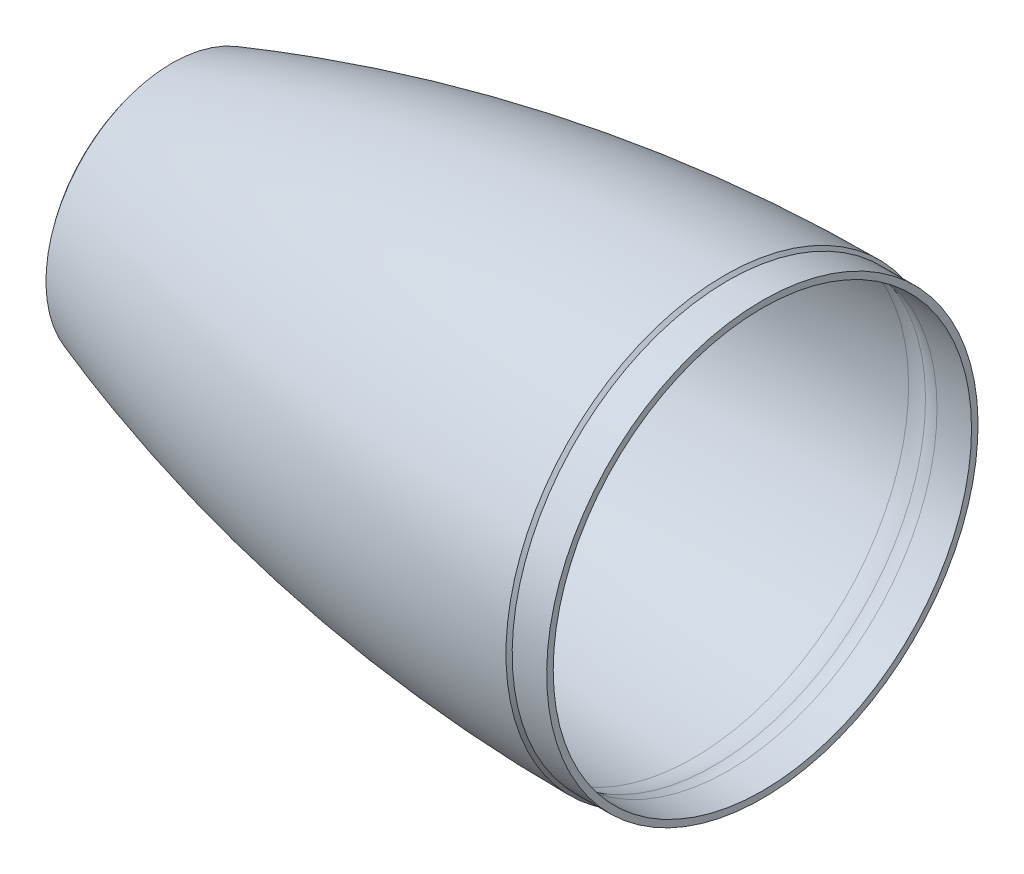
ISO-10303-21;
HEADER;
FILE_DESCRIPTION(('STEP AP214'),'2;1');
FILE_NAME('part.step','',(''),(''),'','','');
FILE_SCHEMA(('AUTOMOTIVE_DESIGN { 1 0 10303 214 1 1 1 1 }'));
ENDSEC;
DATA;
#1=APPLICATION_CONTEXT('core data for automotive mechanical design processes');
#2=APPLICATION_PROTOCOL_DEFINITION('international standard','automotive_design',2000,#1);
#3=PRODUCT_CONTEXT('',#1,'mechanical');
#4=PRODUCT('Part','Part','',(#3));
#5=PRODUCT_RELATED_PRODUCT_CATEGORY('part','',(#4));
#6=PRODUCT_DEFINITION_FORMATION('','',#4);
#7=PRODUCT_DEFINITION_CONTEXT('part definition',#1,'design');
#8=PRODUCT_DEFINITION('design','',#6,#7);
#9=PRODUCT_DEFINITION_SHAPE('','',#8);
#10=(LENGTH_UNIT() NAMED_UNIT(*) SI_UNIT(.MILLI.,.METRE.));
#11=(NAMED_UNIT(*) PLANE_ANGLE_UNIT() SI_UNIT($,.RADIAN.));
#12=(NAMED_UNIT(*) SI_UNIT($,.STERADIAN.) SOLID_ANGLE_UNIT());
#13=UNCERTAINTY_MEASURE_WITH_UNIT(LENGTH_MEASURE(1.E-05),#10,'distance_accuracy_value','');
#14=(GEOMETRIC_REPRESENTATION_CONTEXT(3) GLOBAL_UNCERTAINTY_ASSIGNED_CONTEXT((#13)) GLOBAL_UNIT_ASSIGNED_CONTEXT((#10,
#11,#12)) REPRESENTATION_CONTEXT('',''));
#15=CARTESIAN_POINT('',(0.,0.,0.));
#16=DIRECTION('',(0.,0.,1.));
#17=DIRECTION('',(1.,0.,0.));
#18=AXIS2_PLACEMENT_3D('',#15,#16,#17);
#19=CARTESIAN_POINT('',(-203.454,46.355,0.));
#20=DIRECTION('',(-1.,0.,0.));
#21=DIRECTION('',(0.,-1.,0.));
#22=AXIS2_PLACEMENT_3D('',#19,#20,#21);
#23=PLANE('',#22);
#24=CARTESIAN_POINT('',(-203.454,0.,0.));
#25=DIRECTION('',(1.,0.,0.));
#26=DIRECTION('',(0.,1.,0.));
#27=AXIS2_PLACEMENT_3D('',#24,#25,#26);
#28=CIRCLE('',#27,46.355);
#29=CARTESIAN_POINT('',(-203.454,46.355,0.));
#30=VERTEX_POINT('',#29);
#31=EDGE_CURVE('E55',#30,#30,#28,.T.);
#32=ORIENTED_EDGE('',*,*,#31,.F.);
#33=EDGE_LOOP('',(#32));
#34=FACE_BOUND('',#33,.T.);
#35=CARTESIAN_POINT('',(-203.454,0.,0.));
#36=DIRECTION('',(-1.,0.,0.));
#37=DIRECTION('',(0.,-1.,0.));
#38=AXIS2_PLACEMENT_3D('',#35,#36,#37);
#39=CIRCLE('',#38,44.7325);
#40=CARTESIAN_POINT('',(-203.454,-44.7325,0.));
#41=VERTEX_POINT('',#40);
#42=EDGE_CURVE('E80',#41,#41,#39,.T.);
#43=ORIENTED_EDGE('',*,*,#42,.F.);
#44=EDGE_LOOP('',(#43));
#45=FACE_BOUND('',#44,.T.);
#46=ADVANCED_FACE('F35',(#34,#45),#23,.T.);
#47=CARTESIAN_POINT('',(0.,0.,0.));
#48=DIRECTION('',(1.,0.,0.));
#49=DIRECTION('',(0.,1.,0.));
#50=AXIS2_PLACEMENT_3D('',#47,#48,#49);
#51=DEGENERATE_TOROIDAL_SURFACE('',#50,542.387492565056,622.905492565056,.F.);
#52=ORIENTED_EDGE('',*,*,#31,.T.);
#53=EDGE_LOOP('',(#52));
#54=FACE_BOUND('',#53,.T.);
#55=CARTESIAN_POINT('',(0.,0.,0.));
#56=DIRECTION('',(1.,0.,0.));
#57=DIRECTION('',(0.,1.,0.));
#58=AXIS2_PLACEMENT_3D('',#55,#56,#57);
#59=CIRCLE('',#58,80.518);
#60=CARTESIAN_POINT('',(0.,80.518,0.));
#61=VERTEX_POINT('',#60);
#62=EDGE_CURVE('E76',#61,#61,#59,.T.);
#63=ORIENTED_EDGE('',*,*,#62,.F.);
#64=EDGE_LOOP('',(#63));
#65=FACE_BOUND('',#64,.T.);
#66=ADVANCED_FACE('F105',(#54,#65),#51,.F.);
#67=CARTESIAN_POINT('',(0.,0.,0.));
#68=DIRECTION('',(1.,0.,0.));
#69=DIRECTION('',(0.,1.,0.));
#70=AXIS2_PLACEMENT_3D('',#67,#68,#69);
#71=CYLINDRICAL_SURFACE('',#70,44.1325);
#72=CARTESIAN_POINT('',(-200.890462780487,0.,0.));
#73=DIRECTION('',(-1.,0.,0.));
#74=DIRECTION('',(0.,-1.,0.));
#75=AXIS2_PLACEMENT_3D('',#72,#73,#74);
#76=CIRCLE('',#75,44.1325);
#77=CARTESIAN_POINT('',(-200.890462780487,-44.1325,0.));
#78=VERTEX_POINT('',#77);
#79=EDGE_CURVE('E50',#78,#78,#76,.F.);
#80=ORIENTED_EDGE('',*,*,#79,.T.);
#81=EDGE_LOOP('',(#80));
#82=FACE_BOUND('',#81,.T.);
#83=CARTESIAN_POINT('',(-204.724,0.,0.));
#84=DIRECTION('',(-1.,0.,0.));
#85=DIRECTION('',(0.,-1.,0.));
#86=AXIS2_PLACEMENT_3D('',#83,#84,#85);
#87=CIRCLE('',#86,44.1325);
#88=CARTESIAN_POINT('',(-204.724,-44.1325,0.));
#89=VERTEX_POINT('',#88);
#90=EDGE_CURVE('E83',#89,#89,#87,.T.);
#91=ORIENTED_EDGE('',*,*,#90,.T.);
#92=EDGE_LOOP('',(#91));
#93=FACE_BOUND('',#92,.T.);
#94=ADVANCED_FACE('F89',(#82,#93),#71,.F.);
#95=CARTESIAN_POINT('',(-199.644000000001,0.,0.));
#96=DIRECTION('',(1.,0.,0.));
#97=DIRECTION('',(0.,1.,0.));
#98=AXIS2_PLACEMENT_3D('',#95,#96,#97);
#99=CONICAL_SURFACE('',#98,44.1325,0.748198624853899);
#100=CARTESIAN_POINT('',(-198.730448023021,0.,0.));
#101=DIRECTION('',(-1.,0.,0.));
#102=DIRECTION('',(0.,-1.,0.));
#103=AXIS2_PLACEMENT_3D('',#100,#101,#102);
#104=CIRCLE('',#103,44.9804930710183);
#105=CARTESIAN_POINT('',(-198.730448023021,-44.9804930710183,0.));
#106=VERTEX_POINT('',#105);
#107=EDGE_CURVE('E42',#106,#106,#104,.T.);
#108=ORIENTED_EDGE('',*,*,#107,.T.);
#109=EDGE_LOOP('',(#108));
#110=FACE_BOUND('',#109,.T.);
#111=CARTESIAN_POINT('',(-196.340093002272,0.,0.));
#112=DIRECTION('',(1.,0.,0.));
#113=DIRECTION('',(0.,1.,0.));
#114=AXIS2_PLACEMENT_3D('',#111,#112,#113);
#115=CIRCLE('',#114,47.1993098936485);
#116=CARTESIAN_POINT('',(-196.340093002272,47.1993098936484,0.));
#117=VERTEX_POINT('',#116);
#118=EDGE_CURVE('E46',#117,#117,#115,.T.);
#119=ORIENTED_EDGE('',*,*,#118,.T.);
#120=EDGE_LOOP('',(#119));
#121=FACE_BOUND('',#120,.T.);
#122=ADVANCED_FACE('F130',(#110,#121),#99,.F.);
#123=CARTESIAN_POINT('',(0.,0.,0.));
#124=DIRECTION('',(1.,0.,0.));
#125=DIRECTION('',(0.,1.,0.));
#126=AXIS2_PLACEMENT_3D('',#123,#124,#125);
#127=DEGENERATE_TOROIDAL_SURFACE('',#126,542.387492565056,621.705492565056,.F.);
#128=CARTESIAN_POINT('',(-195.176830637514,0.,0.));
#129=DIRECTION('',(1.,0.,0.));
#130=DIRECTION('',(0.,1.,0.));
#131=AXIS2_PLACEMENT_3D('',#128,#129,#130);
#132=CIRCLE('',#131,47.8867862815272);
#133=CARTESIAN_POINT('',(-195.176830637514,47.8867862815272,0.));
#134=VERTEX_POINT('',#133);
#135=EDGE_CURVE('E10',#134,#134,#132,.F.);
#136=ORIENTED_EDGE('',*,*,#135,.T.);
#137=EDGE_LOOP('',(#136));
#138=FACE_BOUND('',#137,.T.);
#139=CARTESIAN_POINT('',(-11.557,0.,0.));
#140=DIRECTION('',(1.,0.,0.));
#141=DIRECTION('',(0.,1.,0.));
#142=AXIS2_PLACEMENT_3D('',#139,#140,#141);
#143=CIRCLE('',#142,79.210573098407);
#144=CARTESIAN_POINT('',(-11.557,79.210573098407,0.));
#145=VERTEX_POINT('',#144);
#146=EDGE_CURVE('E58',#145,#145,#143,.T.);
#147=ORIENTED_EDGE('',*,*,#146,.T.);
#148=EDGE_LOOP('',(#147));
#149=FACE_BOUND('',#148,.T.);
#150=ADVANCED_FACE('F134',(#138,#149),#127,.T.);
#151=CARTESIAN_POINT('',(-11.17995022867,0.,0.));
#152=DIRECTION('',(1.,0.,0.));
#153=DIRECTION('',(0.,1.,0.));
#154=AXIS2_PLACEMENT_3D('',#151,#152,#153);
#155=TOROIDAL_SURFACE('',#154,58.9307938721757,20.2832840534944);
#156=CARTESIAN_POINT('',(-4.04458467874521,0.,0.));
#157=DIRECTION('',(1.,0.,0.));
#158=DIRECTION('',(0.,1.,0.));
#159=AXIS2_PLACEMENT_3D('',#156,#157,#158);
#160=CIRCLE('',#159,77.9175832390931);
#161=CARTESIAN_POINT('',(-4.04458467874522,77.9175832390931,0.));
#162=VERTEX_POINT('',#161);
#163=EDGE_CURVE('E61',#162,#162,#160,.T.);
#164=ORIENTED_EDGE('',*,*,#163,.T.);
#165=EDGE_LOOP('',(#164));
#166=FACE_BOUND('',#165,.T.);
#167=ORIENTED_EDGE('',*,*,#146,.F.);
#168=EDGE_LOOP('',(#167));
#169=FACE_BOUND('',#168,.T.);
#170=ADVANCED_FACE('F138',(#166,#169),#155,.F.);
#171=CARTESIAN_POINT('',(1.143,0.,0.));
#172=DIRECTION('',(1.,0.,0.));
#173=DIRECTION('',(0.,1.,0.));
#174=AXIS2_PLACEMENT_3D('',#171,#172,#173);
#175=TOROIDAL_SURFACE('',#174,91.7214419102751,14.7464419102751);
#176=CARTESIAN_POINT('',(1.14299999999999,0.,0.));
#177=DIRECTION('',(1.,0.,0.));
#178=DIRECTION('',(0.,1.,0.));
#179=AXIS2_PLACEMENT_3D('',#176,#177,#178);
#180=CIRCLE('',#179,76.975);
#181=CARTESIAN_POINT('',(1.14299999999998,76.975,0.));
#182=VERTEX_POINT('',#181);
#183=EDGE_CURVE('E64',#182,#182,#180,.T.);
#184=ORIENTED_EDGE('',*,*,#183,.T.);
#185=EDGE_LOOP('',(#184));
#186=FACE_BOUND('',#185,.T.);
#187=ORIENTED_EDGE('',*,*,#163,.F.);
#188=EDGE_LOOP('',(#187));
#189=FACE_BOUND('',#188,.T.);
#190=ADVANCED_FACE('F144',(#186,#189),#175,.T.);
#191=CARTESIAN_POINT('',(0.,0.,0.));
#192=DIRECTION('',(1.,0.,0.));
#193=DIRECTION('',(0.,1.,0.));
#194=AXIS2_PLACEMENT_3D('',#191,#192,#193);
#195=CYLINDRICAL_SURFACE('',#194,76.975);
#196=CARTESIAN_POINT('',(13.843,0.,0.));
#197=DIRECTION('',(1.,0.,0.));
#198=DIRECTION('',(0.,1.,0.));
#199=AXIS2_PLACEMENT_3D('',#196,#197,#198);
#200=CIRCLE('',#199,76.975);
#201=CARTESIAN_POINT('',(13.843,76.975,0.));
#202=VERTEX_POINT('',#201);
#203=EDGE_CURVE('E67',#202,#202,#200,.T.);
#204=ORIENTED_EDGE('',*,*,#203,.T.);
#205=EDGE_LOOP('',(#204));
#206=FACE_BOUND('',#205,.T.);
#207=ORIENTED_EDGE('',*,*,#183,.F.);
#208=EDGE_LOOP('',(#207));
#209=FACE_BOUND('',#208,.T.);
#210=ADVANCED_FACE('F148',(#206,#209),#195,.F.);
#211=CARTESIAN_POINT('',(13.843,76.975,0.));
#212=DIRECTION('',(1.,0.,0.));
#213=DIRECTION('',(0.,1.,0.));
#214=AXIS2_PLACEMENT_3D('',#211,#212,#213);
#215=PLANE('',#214);
#216=CARTESIAN_POINT('',(13.843,0.,0.));
#217=DIRECTION('',(1.,0.,0.));
#218=DIRECTION('',(0.,1.,0.));
#219=AXIS2_PLACEMENT_3D('',#216,#217,#218);
#220=CIRCLE('',#219,79.375);
#221=CARTESIAN_POINT('',(13.843,79.375,0.));
#222=VERTEX_POINT('',#221);
#223=EDGE_CURVE('E70',#222,#222,#220,.T.);
#224=ORIENTED_EDGE('',*,*,#223,.T.);
#225=EDGE_LOOP('',(#224));
#226=FACE_BOUND('',#225,.T.);
#227=ORIENTED_EDGE('',*,*,#203,.F.);
#228=EDGE_LOOP('',(#227));
#229=FACE_BOUND('',#228,.T.);
#230=ADVANCED_FACE('F152',(#226,#229),#215,.T.);
#231=CARTESIAN_POINT('',(0.,0.,0.));
#232=DIRECTION('',(1.,0.,0.));
#233=DIRECTION('',(0.,1.,0.));
#234=AXIS2_PLACEMENT_3D('',#231,#232,#233);
#235=CYLINDRICAL_SURFACE('',#234,79.375);
#236=CARTESIAN_POINT('',(1.1429999999996,0.,0.));
#237=DIRECTION('',(1.,0.,0.));
#238=DIRECTION('',(0.,1.,0.));
#239=AXIS2_PLACEMENT_3D('',#236,#237,#238);
#240=CIRCLE('',#239,79.375);
#241=CARTESIAN_POINT('',(1.14299999999959,79.375,0.));
#242=VERTEX_POINT('',#241);
#243=EDGE_CURVE('E73',#242,#242,#240,.T.);
#244=ORIENTED_EDGE('',*,*,#243,.T.);
#245=EDGE_LOOP('',(#244));
#246=FACE_BOUND('',#245,.T.);
#247=ORIENTED_EDGE('',*,*,#223,.F.);
#248=EDGE_LOOP('',(#247));
#249=FACE_BOUND('',#248,.T.);
#250=ADVANCED_FACE('F123',(#246,#249),#235,.T.);
#251=CARTESIAN_POINT('',(1.1429999999996,0.,0.));
#252=DIRECTION('',(-1.,0.,0.));
#253=DIRECTION('',(0.,-1.,0.));
#254=AXIS2_PLACEMENT_3D('',#251,#252,#253);
#255=CONICAL_SURFACE('',#254,79.375,0.785398163397619);
#256=ORIENTED_EDGE('',*,*,#62,.T.);
#257=EDGE_LOOP('',(#256));
#258=FACE_BOUND('',#257,.T.);
#259=ORIENTED_EDGE('',*,*,#243,.F.);
#260=EDGE_LOOP('',(#259));
#261=FACE_BOUND('',#260,.T.);
#262=ADVANCED_FACE('F118',(#258,#261),#255,.T.);
#263=CARTESIAN_POINT('',(-200.890462780487,0.,0.));
#264=DIRECTION('',(-1.,0.,0.));
#265=DIRECTION('',(0.,-1.,0.));
#266=AXIS2_PLACEMENT_3D('',#263,#264,#265);
#267=TOROIDAL_SURFACE('',#266,47.3075,3.175);
#268=ORIENTED_EDGE('',*,*,#107,.F.);
#269=EDGE_LOOP('',(#268));
#270=FACE_BOUND('',#269,.T.);
#271=ORIENTED_EDGE('',*,*,#79,.F.);
#272=EDGE_LOOP('',(#271));
#273=FACE_BOUND('',#272,.T.);
#274=ADVANCED_FACE('F102',(#270,#273),#267,.T.);
#275=CARTESIAN_POINT('',(-194.180078244806,0.,0.));
#276=DIRECTION('',(1.,0.,0.));
#277=DIRECTION('',(0.,1.,0.));
#278=AXIS2_PLACEMENT_3D('',#275,#276,#277);
#279=TOROIDAL_SURFACE('',#278,44.8723029646667,3.175);
#280=ORIENTED_EDGE('',*,*,#135,.F.);
#281=EDGE_LOOP('',(#280));
#282=FACE_BOUND('',#281,.T.);
#283=ORIENTED_EDGE('',*,*,#118,.F.);
#284=EDGE_LOOP('',(#283));
#285=FACE_BOUND('',#284,.T.);
#286=ADVANCED_FACE('F37',(#282,#285),#279,.F.);
#287=CARTESIAN_POINT('',(-204.724,0.,0.));
#288=DIRECTION('',(-1.,0.,0.));
#289=DIRECTION('',(0.,-1.,0.));
#290=AXIS2_PLACEMENT_3D('',#287,#288,#289);
#291=PLANE('',#290);
#292=CARTESIAN_POINT('',(-204.724,0.,0.));
#293=DIRECTION('',(-1.,0.,0.));
#294=DIRECTION('',(0.,-1.,0.));
#295=AXIS2_PLACEMENT_3D('',#292,#293,#294);
#296=CIRCLE('',#295,44.7325);
#297=CARTESIAN_POINT('',(-204.724,-44.7325,0.));
#298=VERTEX_POINT('',#297);
#299=EDGE_CURVE('E79',#298,#298,#296,.T.);
#300=ORIENTED_EDGE('',*,*,#299,.T.);
#301=EDGE_LOOP('',(#300));
#302=FACE_BOUND('',#301,.T.);
#303=ORIENTED_EDGE('',*,*,#90,.F.);
#304=EDGE_LOOP('',(#303));
#305=FACE_BOUND('',#304,.T.);
#306=ADVANCED_FACE('F91',(#302,#305),#291,.T.);
#307=CARTESIAN_POINT('',(-204.724,0.,0.));
#308=DIRECTION('',(1.,0.,0.));
#309=DIRECTION('',(0.,1.,0.));
#310=AXIS2_PLACEMENT_3D('',#307,#308,#309);
#311=CYLINDRICAL_SURFACE('',#310,44.7325);
#312=ORIENTED_EDGE('',*,*,#299,.F.);
#313=EDGE_LOOP('',(#312));
#314=FACE_BOUND('',#313,.T.);
#315=ORIENTED_EDGE('',*,*,#42,.T.);
#316=EDGE_LOOP('',(#315));
#317=FACE_BOUND('',#316,.T.);
#318=ADVANCED_FACE('F93',(#314,#317),#311,.T.);
#319=CLOSED_SHELL('',(#46,#66,#94,#122,#150,#170,#190,#210,#230,#250,#262,#274,#286,#306,#318));
#320=MANIFOLD_SOLID_BREP('B2',#319);
#321=ADVANCED_BREP_SHAPE_REPRESENTATION('',(#18,#320),#14);
#322=SHAPE_DEFINITION_REPRESENTATION(#9,#321);
ENDSEC;
END-ISO-10303-21;
